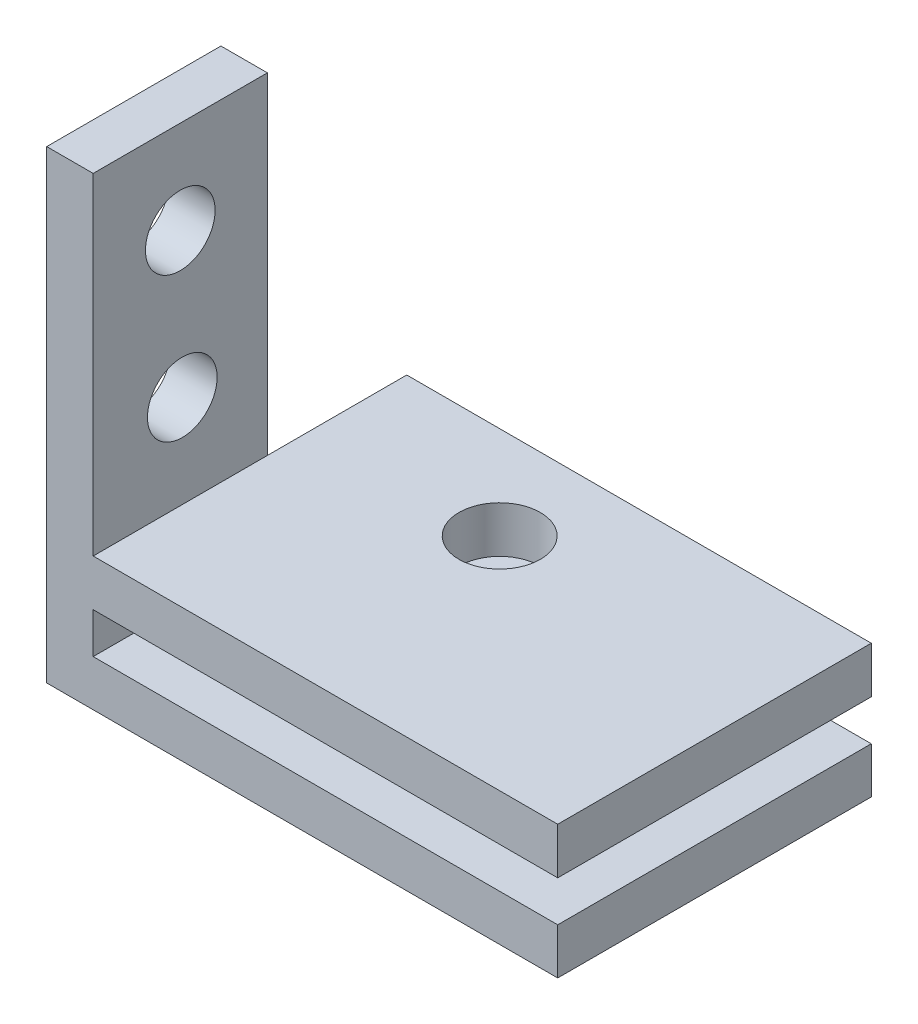
ISO-10303-21;
HEADER;
FILE_DESCRIPTION(('STEP AP214'),'2;1');
FILE_NAME('part.step','',(''),(''),'','','');
FILE_SCHEMA(('AUTOMOTIVE_DESIGN { 1 0 10303 214 1 1 1 1 }'));
ENDSEC;
DATA;
#1=APPLICATION_CONTEXT('core data for automotive mechanical design processes');
#2=APPLICATION_PROTOCOL_DEFINITION('international standard','automotive_design',2000,#1);
#3=PRODUCT_CONTEXT('',#1,'mechanical');
#4=PRODUCT('Part','Part','',(#3));
#5=PRODUCT_RELATED_PRODUCT_CATEGORY('part','',(#4));
#6=PRODUCT_DEFINITION_FORMATION('','',#4);
#7=PRODUCT_DEFINITION_CONTEXT('part definition',#1,'design');
#8=PRODUCT_DEFINITION('design','',#6,#7);
#9=PRODUCT_DEFINITION_SHAPE('','',#8);
#10=(LENGTH_UNIT() NAMED_UNIT(*) SI_UNIT(.MILLI.,.METRE.));
#11=(NAMED_UNIT(*) PLANE_ANGLE_UNIT() SI_UNIT($,.RADIAN.));
#12=(NAMED_UNIT(*) SI_UNIT($,.STERADIAN.) SOLID_ANGLE_UNIT());
#13=UNCERTAINTY_MEASURE_WITH_UNIT(LENGTH_MEASURE(1.E-05),#10,'distance_accuracy_value','');
#14=(GEOMETRIC_REPRESENTATION_CONTEXT(3) GLOBAL_UNCERTAINTY_ASSIGNED_CONTEXT((#13)) GLOBAL_UNIT_ASSIGNED_CONTEXT((#10,
#11,#12)) REPRESENTATION_CONTEXT('',''));
#15=CARTESIAN_POINT('',(0.,0.,0.));
#16=DIRECTION('',(0.,0.,1.));
#17=DIRECTION('',(1.,0.,0.));
#18=AXIS2_PLACEMENT_3D('',#15,#16,#17);
#19=CARTESIAN_POINT('',(2.,9.02439024390244,-6.7595818815331));
#20=DIRECTION('',(0.,0.,1.));
#21=DIRECTION('',(1.,0.,0.));
#22=AXIS2_PLACEMENT_3D('',#19,#20,#21);
#23=PLANE('',#22);
#24=DIRECTION('',(0.,1.,0.));
#25=VECTOR('',#24,1.);
#26=CARTESIAN_POINT('',(2.,-8.99213043612717,-6.7595818815331));
#27=LINE('',#26,#25);
#28=CARTESIAN_POINT('',(2.,-10.9756097560976,-6.7595818815331));
#29=VERTEX_POINT('',#28);
#30=CARTESIAN_POINT('',(2.,-8.99213043612717,-6.7595818815331));
#31=VERTEX_POINT('',#30);
#32=EDGE_CURVE('E169',#29,#31,#27,.T.);
#33=ORIENTED_EDGE('',*,*,#32,.F.);
#34=DIRECTION('',(-1.,0.,0.));
#35=VECTOR('',#34,1.);
#36=CARTESIAN_POINT('',(2.,-10.9756097560976,-6.7595818815331));
#37=LINE('',#36,#35);
#38=CARTESIAN_POINT('',(0.,-10.9756097560976,-6.7595818815331));
#39=VERTEX_POINT('',#38);
#40=EDGE_CURVE('E55',#29,#39,#37,.T.);
#41=ORIENTED_EDGE('',*,*,#40,.T.);
#42=DIRECTION('',(0.,1.,0.));
#43=VECTOR('',#42,1.);
#44=CARTESIAN_POINT('',(0.,9.02439024390244,-6.7595818815331));
#45=LINE('',#44,#43);
#46=CARTESIAN_POINT('',(0.,9.02439024390244,-6.7595818815331));
#47=VERTEX_POINT('',#46);
#48=EDGE_CURVE('E274',#39,#47,#45,.T.);
#49=ORIENTED_EDGE('',*,*,#48,.T.);
#50=DIRECTION('',(-1.,0.,0.));
#51=VECTOR('',#50,1.);
#52=CARTESIAN_POINT('',(2.,9.02439024390244,-6.7595818815331));
#53=LINE('',#52,#51);
#54=CARTESIAN_POINT('',(2.,9.02439024390244,-6.7595818815331));
#55=VERTEX_POINT('',#54);
#56=EDGE_CURVE('E283',#55,#47,#53,.T.);
#57=ORIENTED_EDGE('',*,*,#56,.F.);
#58=DIRECTION('',(0.,1.,0.));
#59=VECTOR('',#58,1.);
#60=CARTESIAN_POINT('',(2.,9.02439024390244,-6.7595818815331));
#61=LINE('',#60,#59);
#62=CARTESIAN_POINT('',(2.,-5.24213043612717,-6.7595818815331));
#63=VERTEX_POINT('',#62);
#64=EDGE_CURVE('E259',#63,#55,#61,.T.);
#65=ORIENTED_EDGE('',*,*,#64,.F.);
#66=DIRECTION('',(0.,1.,0.));
#67=VECTOR('',#66,1.);
#68=CARTESIAN_POINT('',(2.,-5.24213043612717,-6.7595818815331));
#69=LINE('',#68,#67);
#70=CARTESIAN_POINT('',(2.,-7.24213043612718,-6.7595818815331));
#71=VERTEX_POINT('',#70);
#72=EDGE_CURVE('E187',#71,#63,#69,.T.);
#73=ORIENTED_EDGE('',*,*,#72,.F.);
#74=EDGE_CURVE('E261',#31,#71,#61,.T.);
#75=ORIENTED_EDGE('',*,*,#74,.F.);
#76=EDGE_LOOP('',(#33,#41,#49,#57,#65,#73,#75));
#77=FACE_BOUND('',#76,.T.);
#78=ADVANCED_FACE('F45',(#77),#23,.F.);
#79=CARTESIAN_POINT('',(2.,0.,0.));
#80=DIRECTION('',(1.,0.,0.));
#81=DIRECTION('',(0.,0.,-1.));
#82=AXIS2_PLACEMENT_3D('',#79,#80,#81);
#83=PLANE('',#82);
#84=ORIENTED_EDGE('',*,*,#74,.T.);
#85=DIRECTION('',(0.,0.,-1.));
#86=VECTOR('',#85,1.);
#87=CARTESIAN_POINT('',(2.,-7.24213043612717,0.));
#88=LINE('',#87,#86);
#89=CARTESIAN_POINT('',(2.,-7.24213043612718,0.740418118466897));
#90=VERTEX_POINT('',#89);
#91=EDGE_CURVE('E63',#90,#71,#88,.T.);
#92=ORIENTED_EDGE('',*,*,#91,.F.);
#93=DIRECTION('',(0.,-1.,0.));
#94=VECTOR('',#93,1.);
#95=CARTESIAN_POINT('',(2.,9.02439024390244,0.740418118466899));
#96=LINE('',#95,#94);
#97=CARTESIAN_POINT('',(2.,-8.99213043612717,0.740418118466897));
#98=VERTEX_POINT('',#97);
#99=EDGE_CURVE('E260',#90,#98,#96,.T.);
#100=ORIENTED_EDGE('',*,*,#99,.T.);
#101=DIRECTION('',(0.,0.,1.));
#102=VECTOR('',#101,1.);
#103=CARTESIAN_POINT('',(2.,-8.99213043612717,-6.7595818815331));
#104=LINE('',#103,#102);
#105=EDGE_CURVE('E244',#31,#98,#104,.T.);
#106=ORIENTED_EDGE('',*,*,#105,.F.);
#107=EDGE_LOOP('',(#84,#92,#100,#106));
#108=FACE_BOUND('',#107,.T.);
#109=ADVANCED_FACE('F315',(#108),#83,.T.);
#110=CARTESIAN_POINT('',(2.,9.02439024390244,0.740418118466899));
#111=DIRECTION('',(0.,0.,-1.));
#112=DIRECTION('',(0.,1.,0.));
#113=AXIS2_PLACEMENT_3D('',#110,#111,#112);
#114=PLANE('',#113);
#115=DIRECTION('',(0.,-1.,0.));
#116=VECTOR('',#115,1.);
#117=CARTESIAN_POINT('',(0.,9.02439024390244,0.740418118466899));
#118=LINE('',#117,#116);
#119=CARTESIAN_POINT('',(0.,9.02439024390244,0.740418118466899));
#120=VERTEX_POINT('',#119);
#121=CARTESIAN_POINT('',(0.,-10.9756097560976,0.740418118466897));
#122=VERTEX_POINT('',#121);
#123=EDGE_CURVE('E256',#120,#122,#118,.T.);
#124=ORIENTED_EDGE('',*,*,#123,.T.);
#125=DIRECTION('',(-1.,0.,0.));
#126=VECTOR('',#125,1.);
#127=CARTESIAN_POINT('',(2.,-10.9756097560976,0.740418118466897));
#128=LINE('',#127,#126);
#129=CARTESIAN_POINT('',(22.,-10.9756097560976,0.740418118466897));
#130=VERTEX_POINT('',#129);
#131=EDGE_CURVE('E11',#130,#122,#128,.T.);
#132=ORIENTED_EDGE('',*,*,#131,.F.);
#133=DIRECTION('',(0.,-1.,0.));
#134=VECTOR('',#133,1.);
#135=CARTESIAN_POINT('',(22.,-10.9756097560976,0.740418118466897));
#136=LINE('',#135,#134);
#137=CARTESIAN_POINT('',(22.,-8.99213043612717,0.740418118466897));
#138=VERTEX_POINT('',#137);
#139=EDGE_CURVE('E148',#138,#130,#136,.T.);
#140=ORIENTED_EDGE('',*,*,#139,.F.);
#141=DIRECTION('',(-1.,0.,0.));
#142=VECTOR('',#141,1.);
#143=CARTESIAN_POINT('',(22.,-8.99213043612717,0.740418118466897));
#144=LINE('',#143,#142);
#145=EDGE_CURVE('E151',#138,#98,#144,.T.);
#146=ORIENTED_EDGE('',*,*,#145,.T.);
#147=ORIENTED_EDGE('',*,*,#99,.F.);
#148=DIRECTION('',(-1.,0.,0.));
#149=VECTOR('',#148,1.);
#150=CARTESIAN_POINT('',(22.,-7.24213043612717,0.740418118466897));
#151=LINE('',#150,#149);
#152=CARTESIAN_POINT('',(22.,-7.24213043612717,0.740418118466897));
#153=VERTEX_POINT('',#152);
#154=EDGE_CURVE('E231',#153,#90,#151,.T.);
#155=ORIENTED_EDGE('',*,*,#154,.F.);
#156=DIRECTION('',(0.,-1.,0.));
#157=VECTOR('',#156,1.);
#158=CARTESIAN_POINT('',(22.,0.,0.740418118466898));
#159=LINE('',#158,#157);
#160=CARTESIAN_POINT('',(22.,-5.24213043612717,0.740418118466897));
#161=VERTEX_POINT('',#160);
#162=EDGE_CURVE('E225',#161,#153,#159,.T.);
#163=ORIENTED_EDGE('',*,*,#162,.F.);
#164=DIRECTION('',(-1.,0.,0.));
#165=VECTOR('',#164,1.);
#166=CARTESIAN_POINT('',(22.,-5.24213043612717,0.740418118466897));
#167=LINE('',#166,#165);
#168=CARTESIAN_POINT('',(2.,-5.24213043612717,0.740418118466897));
#169=VERTEX_POINT('',#168);
#170=EDGE_CURVE('E241',#161,#169,#167,.T.);
#171=ORIENTED_EDGE('',*,*,#170,.T.);
#172=CARTESIAN_POINT('',(2.,9.02439024390244,0.740418118466899));
#173=VERTEX_POINT('',#172);
#174=EDGE_CURVE('E71',#173,#169,#96,.T.);
#175=ORIENTED_EDGE('',*,*,#174,.F.);
#176=DIRECTION('',(-1.,0.,0.));
#177=VECTOR('',#176,1.);
#178=CARTESIAN_POINT('',(2.,9.02439024390244,0.740418118466899));
#179=LINE('',#178,#177);
#180=EDGE_CURVE('E267',#173,#120,#179,.T.);
#181=ORIENTED_EDGE('',*,*,#180,.T.);
#182=EDGE_LOOP('',(#124,#132,#140,#146,#147,#155,#163,#171,#175,#181));
#183=FACE_BOUND('',#182,.T.);
#184=ADVANCED_FACE('F47',(#183),#114,.F.);
#185=CARTESIAN_POINT('',(2.,-10.9756097560976,0.740418118466897));
#186=DIRECTION('',(0.,1.,0.));
#187=DIRECTION('',(0.,0.,1.));
#188=AXIS2_PLACEMENT_3D('',#185,#186,#187);
#189=PLANE('',#188);
#190=CARTESIAN_POINT('',(10.,-10.9756097560976,-8.7595818815331));
#191=DIRECTION('',(0.,1.,0.));
#192=DIRECTION('',(0.,0.,1.));
#193=AXIS2_PLACEMENT_3D('',#190,#191,#192);
#194=CIRCLE('',#193,1.75);
#195=CARTESIAN_POINT('',(10.,-10.9756097560976,-7.0095818815331));
#196=VERTEX_POINT('',#195);
#197=EDGE_CURVE('E172',#196,#196,#194,.T.);
#198=ORIENTED_EDGE('',*,*,#197,.T.);
#199=EDGE_LOOP('',(#198));
#200=FACE_BOUND('',#199,.T.);
#201=DIRECTION('',(0.,0.,-1.));
#202=VECTOR('',#201,1.);
#203=CARTESIAN_POINT('',(0.,-10.9756097560976,0.740418118466897));
#204=LINE('',#203,#202);
#205=EDGE_CURVE('E271',#122,#39,#204,.T.);
#206=ORIENTED_EDGE('',*,*,#205,.T.);
#207=ORIENTED_EDGE('',*,*,#40,.F.);
#208=DIRECTION('',(0.,0.,1.));
#209=VECTOR('',#208,1.);
#210=CARTESIAN_POINT('',(2.,-10.9756097560976,-12.7595818815331));
#211=LINE('',#210,#209);
#212=CARTESIAN_POINT('',(2.,-10.9756097560976,-12.7595818815331));
#213=VERTEX_POINT('',#212);
#214=EDGE_CURVE('E158',#213,#29,#211,.T.);
#215=ORIENTED_EDGE('',*,*,#214,.F.);
#216=DIRECTION('',(-1.,0.,0.));
#217=VECTOR('',#216,1.);
#218=CARTESIAN_POINT('',(22.,-10.9756097560976,-12.7595818815331));
#219=LINE('',#218,#217);
#220=CARTESIAN_POINT('',(22.,-10.9756097560976,-12.7595818815331));
#221=VERTEX_POINT('',#220);
#222=EDGE_CURVE('E154',#221,#213,#219,.T.);
#223=ORIENTED_EDGE('',*,*,#222,.F.);
#224=DIRECTION('',(0.,0.,-1.));
#225=VECTOR('',#224,1.);
#226=CARTESIAN_POINT('',(22.,-10.9756097560976,-6.7595818815331));
#227=LINE('',#226,#225);
#228=EDGE_CURVE('E142',#130,#221,#227,.T.);
#229=ORIENTED_EDGE('',*,*,#228,.F.);
#230=ORIENTED_EDGE('',*,*,#131,.T.);
#231=EDGE_LOOP('',(#206,#207,#215,#223,#229,#230));
#232=FACE_BOUND('',#231,.T.);
#233=ADVANCED_FACE('F156',(#200,#232),#189,.F.);
#234=CARTESIAN_POINT('',(2.,9.02439024390244,0.740418118466899));
#235=DIRECTION('',(0.,-1.,0.));
#236=DIRECTION('',(0.,0.,-1.));
#237=AXIS2_PLACEMENT_3D('',#234,#235,#236);
#238=PLANE('',#237);
#239=DIRECTION('',(0.,0.,1.));
#240=VECTOR('',#239,1.);
#241=CARTESIAN_POINT('',(0.,9.02439024390244,0.740418118466899));
#242=LINE('',#241,#240);
#243=EDGE_CURVE('E277',#47,#120,#242,.T.);
#244=ORIENTED_EDGE('',*,*,#243,.T.);
#245=ORIENTED_EDGE('',*,*,#180,.F.);
#246=DIRECTION('',(0.,0.,1.));
#247=VECTOR('',#246,1.);
#248=CARTESIAN_POINT('',(2.,9.02439024390244,0.740418118466899));
#249=LINE('',#248,#247);
#250=EDGE_CURVE('E264',#55,#173,#249,.T.);
#251=ORIENTED_EDGE('',*,*,#250,.F.);
#252=ORIENTED_EDGE('',*,*,#56,.T.);
#253=EDGE_LOOP('',(#244,#245,#251,#252));
#254=FACE_BOUND('',#253,.T.);
#255=ADVANCED_FACE('F325',(#254),#238,.F.);
#256=CARTESIAN_POINT('',(2.,5.02439024390244,-3.0095818815331));
#257=DIRECTION('',(1.,0.,0.));
#258=DIRECTION('',(0.,0.,-1.));
#259=AXIS2_PLACEMENT_3D('',#256,#257,#258);
#260=CIRCLE('',#259,1.5);
#261=CARTESIAN_POINT('',(2.,5.02439024390244,-4.5095818815331));
#262=VERTEX_POINT('',#261);
#263=EDGE_CURVE('E214',#262,#262,#260,.T.);
#264=ORIENTED_EDGE('',*,*,#263,.F.);
#265=EDGE_LOOP('',(#264));
#266=FACE_BOUND('',#265,.T.);
#267=CARTESIAN_POINT('',(2.,-1.24213043612717,-3.09645831879379));
#268=DIRECTION('',(1.,0.,0.));
#269=DIRECTION('',(0.,0.,-1.));
#270=AXIS2_PLACEMENT_3D('',#267,#268,#269);
#271=CIRCLE('',#270,1.5);
#272=CARTESIAN_POINT('',(2.,-1.24213043612717,-4.59645831879379));
#273=VERTEX_POINT('',#272);
#274=EDGE_CURVE('E213',#273,#273,#271,.T.);
#275=ORIENTED_EDGE('',*,*,#274,.F.);
#276=EDGE_LOOP('',(#275));
#277=FACE_BOUND('',#276,.T.);
#278=DIRECTION('',(0.,0.,-1.));
#279=VECTOR('',#278,1.);
#280=CARTESIAN_POINT('',(2.,-5.24213043612717,0.));
#281=LINE('',#280,#279);
#282=EDGE_CURVE('E232',#169,#63,#281,.T.);
#283=ORIENTED_EDGE('',*,*,#282,.T.);
#284=ORIENTED_EDGE('',*,*,#64,.T.);
#285=ORIENTED_EDGE('',*,*,#250,.T.);
#286=ORIENTED_EDGE('',*,*,#174,.T.);
#287=EDGE_LOOP('',(#283,#284,#285,#286));
#288=FACE_BOUND('',#287,.T.);
#289=ADVANCED_FACE('F322',(#266,#277,#288),#83,.T.);
#290=CARTESIAN_POINT('',(0.,0.,0.));
#291=DIRECTION('',(1.,0.,0.));
#292=DIRECTION('',(0.,0.,-1.));
#293=AXIS2_PLACEMENT_3D('',#290,#291,#292);
#294=PLANE('',#293);
#295=CARTESIAN_POINT('',(0.,5.02439024390244,-3.0095818815331));
#296=DIRECTION('',(1.,0.,0.));
#297=DIRECTION('',(0.,0.,-1.));
#298=AXIS2_PLACEMENT_3D('',#295,#296,#297);
#299=CIRCLE('',#298,1.5);
#300=CARTESIAN_POINT('',(0.,5.02439024390244,-4.5095818815331));
#301=VERTEX_POINT('',#300);
#302=EDGE_CURVE('E235',#301,#301,#299,.T.);
#303=ORIENTED_EDGE('',*,*,#302,.T.);
#304=EDGE_LOOP('',(#303));
#305=FACE_BOUND('',#304,.T.);
#306=CARTESIAN_POINT('',(0.,-1.24213043612717,-3.09645831879379));
#307=DIRECTION('',(1.,0.,0.));
#308=DIRECTION('',(0.,0.,-1.));
#309=AXIS2_PLACEMENT_3D('',#306,#307,#308);
#310=CIRCLE('',#309,1.5);
#311=CARTESIAN_POINT('',(0.,-1.24213043612717,-4.59645831879379));
#312=VERTEX_POINT('',#311);
#313=EDGE_CURVE('E218',#312,#312,#310,.T.);
#314=ORIENTED_EDGE('',*,*,#313,.T.);
#315=EDGE_LOOP('',(#314));
#316=FACE_BOUND('',#315,.T.);
#317=ORIENTED_EDGE('',*,*,#123,.F.);
#318=ORIENTED_EDGE('',*,*,#243,.F.);
#319=ORIENTED_EDGE('',*,*,#48,.F.);
#320=ORIENTED_EDGE('',*,*,#205,.F.);
#321=EDGE_LOOP('',(#317,#318,#319,#320));
#322=FACE_BOUND('',#321,.T.);
#323=ADVANCED_FACE('F295',(#305,#316,#322),#294,.F.);
#324=CARTESIAN_POINT('',(22.,-8.99213043612717,-6.7595818815331));
#325=DIRECTION('',(0.,-1.,0.));
#326=DIRECTION('',(0.,0.,-1.));
#327=AXIS2_PLACEMENT_3D('',#324,#325,#326);
#328=PLANE('',#327);
#329=CARTESIAN_POINT('',(10.,-8.99213043612717,-8.7595818815331));
#330=DIRECTION('',(0.,-1.,0.));
#331=DIRECTION('',(0.,0.,-1.));
#332=AXIS2_PLACEMENT_3D('',#329,#330,#331);
#333=CIRCLE('',#332,1.75);
#334=CARTESIAN_POINT('',(10.,-8.99213043612717,-10.5095818815331));
#335=VERTEX_POINT('',#334);
#336=EDGE_CURVE('E339',#335,#335,#333,.T.);
#337=ORIENTED_EDGE('',*,*,#336,.T.);
#338=EDGE_LOOP('',(#337));
#339=FACE_BOUND('',#338,.T.);
#340=ORIENTED_EDGE('',*,*,#105,.T.);
#341=ORIENTED_EDGE('',*,*,#145,.F.);
#342=DIRECTION('',(0.,0.,1.));
#343=VECTOR('',#342,1.);
#344=CARTESIAN_POINT('',(22.,-8.99213043612717,-6.7595818815331));
#345=LINE('',#344,#343);
#346=CARTESIAN_POINT('',(22.,-8.99213043612717,-12.7595818815331));
#347=VERTEX_POINT('',#346);
#348=EDGE_CURVE('E245',#347,#138,#345,.T.);
#349=ORIENTED_EDGE('',*,*,#348,.F.);
#350=DIRECTION('',(1.,0.,0.));
#351=VECTOR('',#350,1.);
#352=CARTESIAN_POINT('',(22.,-8.99213043612717,-12.7595818815331));
#353=LINE('',#352,#351);
#354=CARTESIAN_POINT('',(2.,-8.99213043612717,-12.7595818815331));
#355=VERTEX_POINT('',#354);
#356=EDGE_CURVE('E167',#355,#347,#353,.T.);
#357=ORIENTED_EDGE('',*,*,#356,.F.);
#358=DIRECTION('',(0.,0.,1.));
#359=VECTOR('',#358,1.);
#360=CARTESIAN_POINT('',(2.,-8.99213043612717,-12.7595818815331));
#361=LINE('',#360,#359);
#362=EDGE_CURVE('E180',#355,#31,#361,.T.);
#363=ORIENTED_EDGE('',*,*,#362,.T.);
#364=EDGE_LOOP('',(#340,#341,#349,#357,#363));
#365=FACE_BOUND('',#364,.T.);
#366=ADVANCED_FACE('F380',(#339,#365),#328,.F.);
#367=CARTESIAN_POINT('',(22.,0.,0.));
#368=DIRECTION('',(1.,0.,0.));
#369=DIRECTION('',(0.,0.,-1.));
#370=AXIS2_PLACEMENT_3D('',#367,#368,#369);
#371=PLANE('',#370);
#372=ORIENTED_EDGE('',*,*,#228,.T.);
#373=DIRECTION('',(0.,-1.,0.));
#374=VECTOR('',#373,1.);
#375=CARTESIAN_POINT('',(22.,-8.99213043612717,-12.7595818815331));
#376=LINE('',#375,#374);
#377=EDGE_CURVE('E146',#347,#221,#376,.T.);
#378=ORIENTED_EDGE('',*,*,#377,.F.);
#379=ORIENTED_EDGE('',*,*,#348,.T.);
#380=ORIENTED_EDGE('',*,*,#139,.T.);
#381=EDGE_LOOP('',(#372,#378,#379,#380));
#382=FACE_BOUND('',#381,.T.);
#383=ADVANCED_FACE('F144',(#382),#371,.T.);
#384=CARTESIAN_POINT('',(22.,-5.24213043612717,0.));
#385=DIRECTION('',(0.,1.,0.));
#386=DIRECTION('',(0.,0.,1.));
#387=AXIS2_PLACEMENT_3D('',#384,#385,#386);
#388=PLANE('',#387);
#389=CARTESIAN_POINT('',(10.,-5.24213043612717,-8.7595818815331));
#390=DIRECTION('',(0.,1.,0.));
#391=DIRECTION('',(0.,0.,1.));
#392=AXIS2_PLACEMENT_3D('',#389,#390,#391);
#393=CIRCLE('',#392,1.75);
#394=CARTESIAN_POINT('',(10.,-5.24213043612717,-7.0095818815331));
#395=VERTEX_POINT('',#394);
#396=EDGE_CURVE('E346',#395,#395,#393,.T.);
#397=ORIENTED_EDGE('',*,*,#396,.F.);
#398=EDGE_LOOP('',(#397));
#399=FACE_BOUND('',#398,.T.);
#400=ORIENTED_EDGE('',*,*,#282,.F.);
#401=ORIENTED_EDGE('',*,*,#170,.F.);
#402=DIRECTION('',(0.,0.,-1.));
#403=VECTOR('',#402,1.);
#404=CARTESIAN_POINT('',(22.,-5.24213043612717,0.));
#405=LINE('',#404,#403);
#406=CARTESIAN_POINT('',(22.,-5.24213043612717,-12.7595818815331));
#407=VERTEX_POINT('',#406);
#408=EDGE_CURVE('E222',#161,#407,#405,.T.);
#409=ORIENTED_EDGE('',*,*,#408,.T.);
#410=DIRECTION('',(1.,0.,0.));
#411=VECTOR('',#410,1.);
#412=CARTESIAN_POINT('',(22.,-5.24213043612717,-12.7595818815331));
#413=LINE('',#412,#411);
#414=CARTESIAN_POINT('',(2.,-5.24213043612717,-12.7595818815331));
#415=VERTEX_POINT('',#414);
#416=EDGE_CURVE('E198',#415,#407,#413,.T.);
#417=ORIENTED_EDGE('',*,*,#416,.F.);
#418=DIRECTION('',(0.,0.,1.));
#419=VECTOR('',#418,1.);
#420=CARTESIAN_POINT('',(2.,-5.24213043612717,-12.7595818815331));
#421=LINE('',#420,#419);
#422=EDGE_CURVE('E202',#415,#63,#421,.T.);
#423=ORIENTED_EDGE('',*,*,#422,.T.);
#424=EDGE_LOOP('',(#400,#401,#409,#417,#423));
#425=FACE_BOUND('',#424,.T.);
#426=ADVANCED_FACE('F355',(#399,#425),#388,.T.);
#427=CARTESIAN_POINT('',(22.,-7.24213043612717,0.));
#428=DIRECTION('',(0.,1.,0.));
#429=DIRECTION('',(0.,0.,1.));
#430=AXIS2_PLACEMENT_3D('',#427,#428,#429);
#431=PLANE('',#430);
#432=CARTESIAN_POINT('',(10.,-7.24213043612717,-8.7595818815331));
#433=DIRECTION('',(0.,1.,0.));
#434=DIRECTION('',(0.,0.,1.));
#435=AXIS2_PLACEMENT_3D('',#432,#433,#434);
#436=CIRCLE('',#435,1.75);
#437=CARTESIAN_POINT('',(10.,-7.24213043612717,-7.0095818815331));
#438=VERTEX_POINT('',#437);
#439=EDGE_CURVE('E49',#438,#438,#436,.T.);
#440=ORIENTED_EDGE('',*,*,#439,.T.);
#441=EDGE_LOOP('',(#440));
#442=FACE_BOUND('',#441,.T.);
#443=ORIENTED_EDGE('',*,*,#91,.T.);
#444=DIRECTION('',(0.,0.,1.));
#445=VECTOR('',#444,1.);
#446=CARTESIAN_POINT('',(2.,-7.24213043612718,-12.7595818815331));
#447=LINE('',#446,#445);
#448=CARTESIAN_POINT('',(2.,-7.24213043612718,-12.7595818815331));
#449=VERTEX_POINT('',#448);
#450=EDGE_CURVE('E209',#449,#71,#447,.T.);
#451=ORIENTED_EDGE('',*,*,#450,.F.);
#452=DIRECTION('',(-1.,0.,0.));
#453=VECTOR('',#452,1.);
#454=CARTESIAN_POINT('',(22.,-7.24213043612718,-12.7595818815331));
#455=LINE('',#454,#453);
#456=CARTESIAN_POINT('',(22.,-7.24213043612718,-12.7595818815331));
#457=VERTEX_POINT('',#456);
#458=EDGE_CURVE('E192',#457,#449,#455,.T.);
#459=ORIENTED_EDGE('',*,*,#458,.F.);
#460=DIRECTION('',(0.,0.,-1.));
#461=VECTOR('',#460,1.);
#462=CARTESIAN_POINT('',(22.,-7.24213043612717,0.));
#463=LINE('',#462,#461);
#464=EDGE_CURVE('E228',#153,#457,#463,.T.);
#465=ORIENTED_EDGE('',*,*,#464,.F.);
#466=ORIENTED_EDGE('',*,*,#154,.T.);
#467=EDGE_LOOP('',(#443,#451,#459,#465,#466));
#468=FACE_BOUND('',#467,.T.);
#469=ADVANCED_FACE('F358',(#442,#468),#431,.F.);
#470=CARTESIAN_POINT('',(22.,0.,0.));
#471=DIRECTION('',(1.,0.,0.));
#472=DIRECTION('',(0.,0.,-1.));
#473=AXIS2_PLACEMENT_3D('',#470,#471,#472);
#474=PLANE('',#473);
#475=ORIENTED_EDGE('',*,*,#408,.F.);
#476=ORIENTED_EDGE('',*,*,#162,.T.);
#477=ORIENTED_EDGE('',*,*,#464,.T.);
#478=DIRECTION('',(0.,-1.,0.));
#479=VECTOR('',#478,1.);
#480=CARTESIAN_POINT('',(22.,-5.24213043612717,-12.7595818815331));
#481=LINE('',#480,#479);
#482=EDGE_CURVE('E188',#407,#457,#481,.T.);
#483=ORIENTED_EDGE('',*,*,#482,.F.);
#484=EDGE_LOOP('',(#475,#476,#477,#483));
#485=FACE_BOUND('',#484,.T.);
#486=ADVANCED_FACE('F311',(#485),#474,.T.);
#487=CARTESIAN_POINT('',(-18.,-1.24213043612717,-3.09645831879379));
#488=DIRECTION('',(1.,0.,0.));
#489=DIRECTION('',(0.,0.,-1.));
#490=AXIS2_PLACEMENT_3D('',#487,#488,#489);
#491=CYLINDRICAL_SURFACE('',#490,1.5);
#492=ORIENTED_EDGE('',*,*,#274,.T.);
#493=EDGE_LOOP('',(#492));
#494=FACE_BOUND('',#493,.T.);
#495=ORIENTED_EDGE('',*,*,#313,.F.);
#496=EDGE_LOOP('',(#495));
#497=FACE_BOUND('',#496,.T.);
#498=ADVANCED_FACE('F301',(#494,#497),#491,.F.);
#499=CARTESIAN_POINT('',(-18.,5.02439024390244,-3.0095818815331));
#500=DIRECTION('',(1.,0.,0.));
#501=DIRECTION('',(0.,0.,-1.));
#502=AXIS2_PLACEMENT_3D('',#499,#500,#501);
#503=CYLINDRICAL_SURFACE('',#502,1.5);
#504=ORIENTED_EDGE('',*,*,#263,.T.);
#505=EDGE_LOOP('',(#504));
#506=FACE_BOUND('',#505,.T.);
#507=ORIENTED_EDGE('',*,*,#302,.F.);
#508=EDGE_LOOP('',(#507));
#509=FACE_BOUND('',#508,.T.);
#510=ADVANCED_FACE('F298',(#506,#509),#503,.F.);
#511=CARTESIAN_POINT('',(2.,-5.24213043612717,-12.7595818815331));
#512=DIRECTION('',(1.,0.,0.));
#513=DIRECTION('',(0.,0.,-1.));
#514=AXIS2_PLACEMENT_3D('',#511,#512,#513);
#515=PLANE('',#514);
#516=ORIENTED_EDGE('',*,*,#72,.T.);
#517=ORIENTED_EDGE('',*,*,#422,.F.);
#518=DIRECTION('',(0.,1.,0.));
#519=VECTOR('',#518,1.);
#520=CARTESIAN_POINT('',(2.,-5.24213043612717,-12.7595818815331));
#521=LINE('',#520,#519);
#522=EDGE_CURVE('E195',#449,#415,#521,.T.);
#523=ORIENTED_EDGE('',*,*,#522,.F.);
#524=ORIENTED_EDGE('',*,*,#450,.T.);
#525=EDGE_LOOP('',(#516,#517,#523,#524));
#526=FACE_BOUND('',#525,.T.);
#527=ADVANCED_FACE('F300',(#526),#515,.F.);
#528=CARTESIAN_POINT('',(0.,0.,-12.7595818815331));
#529=DIRECTION('',(0.,0.,-1.));
#530=DIRECTION('',(-1.,0.,0.));
#531=AXIS2_PLACEMENT_3D('',#528,#529,#530);
#532=PLANE('',#531);
#533=ORIENTED_EDGE('',*,*,#482,.T.);
#534=ORIENTED_EDGE('',*,*,#458,.T.);
#535=ORIENTED_EDGE('',*,*,#522,.T.);
#536=ORIENTED_EDGE('',*,*,#416,.T.);
#537=EDGE_LOOP('',(#533,#534,#535,#536));
#538=FACE_BOUND('',#537,.T.);
#539=ADVANCED_FACE('F308',(#538),#532,.T.);
#540=CARTESIAN_POINT('',(2.,-8.99213043612717,-12.7595818815331));
#541=DIRECTION('',(1.,0.,0.));
#542=DIRECTION('',(0.,0.,-1.));
#543=AXIS2_PLACEMENT_3D('',#540,#541,#542);
#544=PLANE('',#543);
#545=ORIENTED_EDGE('',*,*,#32,.T.);
#546=ORIENTED_EDGE('',*,*,#362,.F.);
#547=DIRECTION('',(0.,1.,0.));
#548=VECTOR('',#547,1.);
#549=CARTESIAN_POINT('',(2.,-8.99213043612717,-12.7595818815331));
#550=LINE('',#549,#548);
#551=EDGE_CURVE('E162',#213,#355,#550,.T.);
#552=ORIENTED_EDGE('',*,*,#551,.F.);
#553=ORIENTED_EDGE('',*,*,#214,.T.);
#554=EDGE_LOOP('',(#545,#546,#552,#553));
#555=FACE_BOUND('',#554,.T.);
#556=ADVANCED_FACE('F383',(#555),#544,.F.);
#557=CARTESIAN_POINT('',(0.,0.,-12.7595818815331));
#558=DIRECTION('',(0.,0.,-1.));
#559=DIRECTION('',(-1.,0.,0.));
#560=AXIS2_PLACEMENT_3D('',#557,#558,#559);
#561=PLANE('',#560);
#562=ORIENTED_EDGE('',*,*,#377,.T.);
#563=ORIENTED_EDGE('',*,*,#222,.T.);
#564=ORIENTED_EDGE('',*,*,#551,.T.);
#565=ORIENTED_EDGE('',*,*,#356,.T.);
#566=EDGE_LOOP('',(#562,#563,#564,#565));
#567=FACE_BOUND('',#566,.T.);
#568=ADVANCED_FACE('F165',(#567),#561,.T.);
#569=CARTESIAN_POINT('',(10.,-11.2421304361272,-8.7595818815331));
#570=DIRECTION('',(0.,1.,0.));
#571=DIRECTION('',(0.,0.,1.));
#572=AXIS2_PLACEMENT_3D('',#569,#570,#571);
#573=CYLINDRICAL_SURFACE('',#572,1.75);
#574=ORIENTED_EDGE('',*,*,#396,.T.);
#575=EDGE_LOOP('',(#574));
#576=FACE_BOUND('',#575,.T.);
#577=ORIENTED_EDGE('',*,*,#439,.F.);
#578=EDGE_LOOP('',(#577));
#579=FACE_BOUND('',#578,.T.);
#580=ADVANCED_FACE('F352',(#576,#579),#573,.F.);
#581=ORIENTED_EDGE('',*,*,#336,.F.);
#582=EDGE_LOOP('',(#581));
#583=FACE_BOUND('',#582,.T.);
#584=ORIENTED_EDGE('',*,*,#197,.F.);
#585=EDGE_LOOP('',(#584));
#586=FACE_BOUND('',#585,.T.);
#587=ADVANCED_FACE('F417',(#583,#586),#573,.F.);
#588=CLOSED_SHELL('',(#78,#109,#184,#233,#255,#289,#323,#366,#383,#426,#469,#486,#498,#510,#527,
#539,#556,#568,#580,#587));
#589=MANIFOLD_SOLID_BREP('B2',#588);
#590=ADVANCED_BREP_SHAPE_REPRESENTATION('',(#18,#589),#14);
#591=SHAPE_DEFINITION_REPRESENTATION(#9,#590);
ENDSEC;
END-ISO-10303-21;
